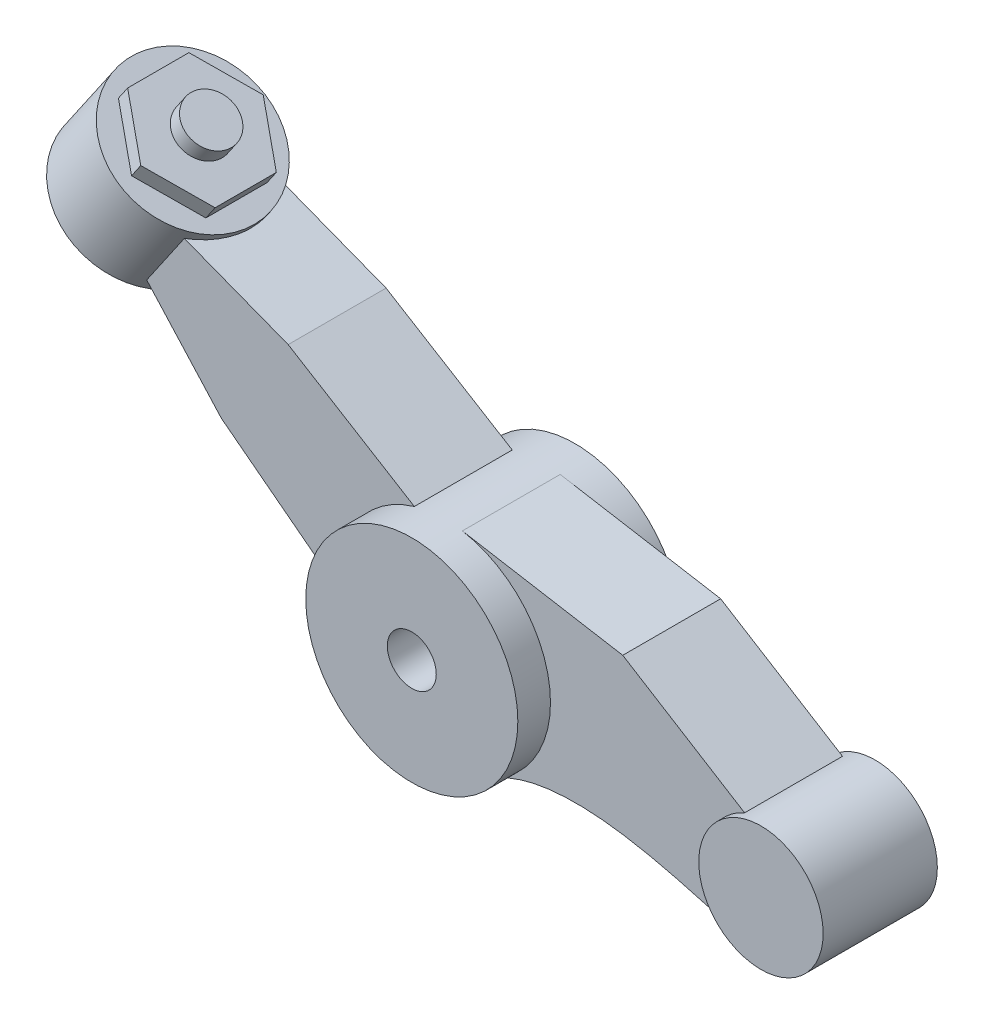
ISO-10303-21;
HEADER;
FILE_DESCRIPTION(('STEP AP214'),'2;1');
FILE_NAME('part.step','',(''),(''),'','','');
FILE_SCHEMA(('AUTOMOTIVE_DESIGN { 1 0 10303 214 1 1 1 1 }'));
ENDSEC;
DATA;
#1=APPLICATION_CONTEXT('core data for automotive mechanical design processes');
#2=APPLICATION_PROTOCOL_DEFINITION('international standard','automotive_design',2000,#1);
#3=PRODUCT_CONTEXT('',#1,'mechanical');
#4=PRODUCT('Part','Part','',(#3));
#5=PRODUCT_RELATED_PRODUCT_CATEGORY('part','',(#4));
#6=PRODUCT_DEFINITION_FORMATION('','',#4);
#7=PRODUCT_DEFINITION_CONTEXT('part definition',#1,'design');
#8=PRODUCT_DEFINITION('design','',#6,#7);
#9=PRODUCT_DEFINITION_SHAPE('','',#8);
#10=(LENGTH_UNIT() NAMED_UNIT(*) SI_UNIT(.MILLI.,.METRE.));
#11=(NAMED_UNIT(*) PLANE_ANGLE_UNIT() SI_UNIT($,.RADIAN.));
#12=(NAMED_UNIT(*) SI_UNIT($,.STERADIAN.) SOLID_ANGLE_UNIT());
#13=UNCERTAINTY_MEASURE_WITH_UNIT(LENGTH_MEASURE(1.E-05),#10,'distance_accuracy_value','');
#14=(GEOMETRIC_REPRESENTATION_CONTEXT(3) GLOBAL_UNCERTAINTY_ASSIGNED_CONTEXT((#13)) GLOBAL_UNIT_ASSIGNED_CONTEXT((#10,
#11,#12)) REPRESENTATION_CONTEXT('',''));
#15=CARTESIAN_POINT('',(0.,0.,0.));
#16=DIRECTION('',(0.,0.,1.));
#17=DIRECTION('',(1.,0.,0.));
#18=AXIS2_PLACEMENT_3D('',#15,#16,#17);
#19=CARTESIAN_POINT('',(-3.68497907935186,3.17508886054395,0.));
#20=DIRECTION('',(-0.565974647839502,-0.824422645251179,0.));
#21=DIRECTION('',(0.824422645251179,-0.565974647839502,0.));
#22=AXIS2_PLACEMENT_3D('',#19,#20,#21);
#23=PLANE('',#22);
#24=CARTESIAN_POINT('',(-3.68497907935186,3.17508886054395,0.));
#25=DIRECTION('',(-0.565974647839502,-0.824422645251179,0.));
#26=DIRECTION('',(0.824422645251179,-0.565974647839502,0.));
#27=AXIS2_PLACEMENT_3D('',#24,#25,#26);
#28=CIRCLE('',#27,0.913);
#29=CARTESIAN_POINT('',(-2.93228120423753,2.65835400706648,0.));
#30=VERTEX_POINT('',#29);
#31=EDGE_CURVE('E200',#30,#30,#28,.T.);
#32=ORIENTED_EDGE('',*,*,#31,.F.);
#33=EDGE_LOOP('',(#32));
#34=FACE_BOUND('',#33,.T.);
#35=DIRECTION('',(0.,0.,-1.));
#36=VECTOR('',#35,1.);
#37=CARTESIAN_POINT('',(-3.14910435993859,2.80720533944827,0.));
#38=LINE('',#37,#36);
#39=CARTESIAN_POINT('',(-3.14910435993859,2.80720533944827,0.375277674973257));
#40=VERTEX_POINT('',#39);
#41=CARTESIAN_POINT('',(-3.14910435993859,2.80720533944827,-0.375277674973258));
#42=VERTEX_POINT('',#41);
#43=EDGE_CURVE('E11',#40,#42,#38,.T.);
#44=ORIENTED_EDGE('',*,*,#43,.F.);
#45=DIRECTION('',(0.713970954242687,-0.49014842292696,-0.5));
#46=VECTOR('',#45,1.);
#47=CARTESIAN_POINT('',(-3.41704171964522,2.99114709999611,0.562916512459885));
#48=LINE('',#47,#46);
#49=CARTESIAN_POINT('',(-3.68497907935185,3.17508886054395,0.750555349946513));
#50=VERTEX_POINT('',#49);
#51=EDGE_CURVE('E434',#50,#40,#48,.T.);
#52=ORIENTED_EDGE('',*,*,#51,.F.);
#53=DIRECTION('',(0.713970954242688,-0.490148422926961,0.5));
#54=VECTOR('',#53,1.);
#55=CARTESIAN_POINT('',(-3.95291643905849,3.35903062109179,0.562916512459885));
#56=LINE('',#55,#54);
#57=CARTESIAN_POINT('',(-4.22085379876512,3.54297238163963,0.375277674973257));
#58=VERTEX_POINT('',#57);
#59=EDGE_CURVE('E438',#58,#50,#56,.T.);
#60=ORIENTED_EDGE('',*,*,#59,.F.);
#61=DIRECTION('',(0.,0.,1.));
#62=VECTOR('',#61,1.);
#63=CARTESIAN_POINT('',(-4.22085379876512,3.54297238163963,0.));
#64=LINE('',#63,#62);
#65=CARTESIAN_POINT('',(-4.22085379876512,3.54297238163963,-0.375277674973258));
#66=VERTEX_POINT('',#65);
#67=EDGE_CURVE('E442',#66,#58,#64,.T.);
#68=ORIENTED_EDGE('',*,*,#67,.F.);
#69=DIRECTION('',(-0.713970954242688,0.490148422926961,0.5));
#70=VECTOR('',#69,1.);
#71=CARTESIAN_POINT('',(-3.95291643905849,3.35903062109179,-0.562916512459886));
#72=LINE('',#71,#70);
#73=CARTESIAN_POINT('',(-3.68497907935186,3.17508886054395,-0.750555349946515));
#74=VERTEX_POINT('',#73);
#75=EDGE_CURVE('E65',#74,#66,#72,.T.);
#76=ORIENTED_EDGE('',*,*,#75,.F.);
#77=DIRECTION('',(-0.713970954242687,0.49014842292696,-0.5));
#78=VECTOR('',#77,1.);
#79=CARTESIAN_POINT('',(-3.41704171964522,2.99114709999611,-0.562916512459886));
#80=LINE('',#79,#78);
#81=EDGE_CURVE('E55',#42,#74,#80,.T.);
#82=ORIENTED_EDGE('',*,*,#81,.F.);
#83=EDGE_LOOP('',(#44,#52,#60,#68,#76,#82));
#84=FACE_BOUND('',#83,.T.);
#85=ADVANCED_FACE('F45',(#34,#84),#23,.F.);
#86=CARTESIAN_POINT('',(0.,0.,0.6));
#87=DIRECTION('',(0.,0.,1.));
#88=DIRECTION('',(1.,0.,0.));
#89=AXIS2_PLACEMENT_3D('',#86,#87,#88);
#90=PLANE('',#89);
#91=DIRECTION('',(0.933092962339422,-0.359635264723361,0.));
#92=VECTOR('',#91,1.);
#93=CARTESIAN_POINT('',(0.487915488116081,1.2659228747429,0.6));
#94=LINE('',#93,#92);
#95=CARTESIAN_POINT('',(-3.18822487820931,2.68279104025666,0.6));
#96=VERTEX_POINT('',#95);
#97=CARTESIAN_POINT('',(-1.91541178651957,2.1922199057091,0.6));
#98=VERTEX_POINT('',#97);
#99=EDGE_CURVE('E223',#96,#98,#94,.T.);
#100=ORIENTED_EDGE('',*,*,#99,.F.);
#101=DIRECTION('',(-0.565974647839502,-0.824422645251179,0.));
#102=VECTOR('',#101,1.);
#103=CARTESIAN_POINT('',(-3.72663022902847,1.89852700080874,0.6));
#104=LINE('',#103,#102);
#105=CARTESIAN_POINT('',(-3.64926695857222,2.01121761746144,0.6));
#106=VERTEX_POINT('',#105);
#107=EDGE_CURVE('E211',#96,#106,#104,.T.);
#108=ORIENTED_EDGE('',*,*,#107,.T.);
#109=DIRECTION('',(0.670915955160537,-0.741533398513529,0.));
#110=VECTOR('',#109,1.);
#111=CARTESIAN_POINT('',(-1.0060349069728,-0.910228550581171,0.6));
#112=LINE('',#111,#110);
#113=CARTESIAN_POINT('',(-2.73408417870121,0.999707022432565,0.6));
#114=VERTEX_POINT('',#113);
#115=EDGE_CURVE('E226',#106,#114,#112,.T.);
#116=ORIENTED_EDGE('',*,*,#115,.T.);
#117=DIRECTION('',(0.79337488847065,-0.60873334584544,0.));
#118=VECTOR('',#117,1.);
#119=CARTESIAN_POINT('',(-0.530319824058384,-0.691176907159155,0.6));
#120=LINE('',#119,#118);
#121=CARTESIAN_POINT('',(-1.29584863415519,-0.103809042756995,0.6));
#122=VERTEX_POINT('',#121);
#123=EDGE_CURVE('E229',#114,#122,#120,.T.);
#124=ORIENTED_EDGE('',*,*,#123,.T.);
#125=CARTESIAN_POINT('',(0.,0.,0.6));
#126=DIRECTION('',(0.,0.,1.));
#127=DIRECTION('',(1.,0.,0.));
#128=AXIS2_PLACEMENT_3D('',#125,#126,#127);
#129=CIRCLE('',#128,1.3);
#130=CARTESIAN_POINT('',(-0.368782160994086,1.24659525016444,0.6));
#131=VERTEX_POINT('',#130);
#132=EDGE_CURVE('E215',#131,#122,#129,.T.);
#133=ORIENTED_EDGE('',*,*,#132,.F.);
#134=DIRECTION('',(0.853168391860319,-0.521635596111383,0.));
#135=VECTOR('',#134,1.);
#136=CARTESIAN_POINT('',(0.454441504544451,0.743268156002117,0.6));
#137=LINE('',#136,#135);
#138=EDGE_CURVE('E218',#98,#131,#137,.T.);
#139=ORIENTED_EDGE('',*,*,#138,.F.);
#140=EDGE_LOOP('',(#100,#108,#116,#124,#133,#139));
#141=FACE_BOUND('',#140,.T.);
#142=ADVANCED_FACE('F311',(#141),#90,.T.);
#143=CARTESIAN_POINT('',(0.,0.,-0.6));
#144=DIRECTION('',(0.,0.,1.));
#145=DIRECTION('',(1.,0.,0.));
#146=AXIS2_PLACEMENT_3D('',#143,#144,#145);
#147=PLANE('',#146);
#148=DIRECTION('',(-0.565974647839502,-0.824422645251179,0.));
#149=VECTOR('',#148,1.);
#150=CARTESIAN_POINT('',(-3.72663022902847,1.89852700080874,-0.6));
#151=LINE('',#150,#149);
#152=CARTESIAN_POINT('',(-3.18822487820931,2.68279104025666,-0.6));
#153=VERTEX_POINT('',#152);
#154=CARTESIAN_POINT('',(-3.64926695857222,2.01121761746144,-0.6));
#155=VERTEX_POINT('',#154);
#156=EDGE_CURVE('E420',#153,#155,#151,.T.);
#157=ORIENTED_EDGE('',*,*,#156,.F.);
#158=DIRECTION('',(0.933092962339422,-0.359635264723361,0.));
#159=VECTOR('',#158,1.);
#160=CARTESIAN_POINT('',(0.487915488116081,1.2659228747429,-0.6));
#161=LINE('',#160,#159);
#162=CARTESIAN_POINT('',(-1.91541178651957,2.1922199057091,-0.6));
#163=VERTEX_POINT('',#162);
#164=EDGE_CURVE('E241',#153,#163,#161,.T.);
#165=ORIENTED_EDGE('',*,*,#164,.T.);
#166=DIRECTION('',(0.853168391860319,-0.521635596111383,0.));
#167=VECTOR('',#166,1.);
#168=CARTESIAN_POINT('',(0.454441504544451,0.743268156002117,-0.6));
#169=LINE('',#168,#167);
#170=CARTESIAN_POINT('',(-0.368782160994086,1.24659525016444,-0.6));
#171=VERTEX_POINT('',#170);
#172=EDGE_CURVE('E237',#163,#171,#169,.T.);
#173=ORIENTED_EDGE('',*,*,#172,.T.);
#174=CARTESIAN_POINT('',(0.,0.,-0.6));
#175=DIRECTION('',(0.,0.,1.));
#176=DIRECTION('',(1.,0.,0.));
#177=AXIS2_PLACEMENT_3D('',#174,#175,#176);
#178=CIRCLE('',#177,1.3);
#179=CARTESIAN_POINT('',(-1.29584863415519,-0.103809042756995,-0.6));
#180=VERTEX_POINT('',#179);
#181=EDGE_CURVE('E214',#171,#180,#178,.T.);
#182=ORIENTED_EDGE('',*,*,#181,.T.);
#183=DIRECTION('',(0.79337488847065,-0.60873334584544,0.));
#184=VECTOR('',#183,1.);
#185=CARTESIAN_POINT('',(-0.530319824058384,-0.691176907159155,-0.6));
#186=LINE('',#185,#184);
#187=CARTESIAN_POINT('',(-2.73408417870121,0.999707022432565,-0.6));
#188=VERTEX_POINT('',#187);
#189=EDGE_CURVE('E219',#188,#180,#186,.T.);
#190=ORIENTED_EDGE('',*,*,#189,.F.);
#191=DIRECTION('',(0.670915955160537,-0.741533398513529,0.));
#192=VECTOR('',#191,1.);
#193=CARTESIAN_POINT('',(-1.0060349069728,-0.910228550581171,-0.6));
#194=LINE('',#193,#192);
#195=EDGE_CURVE('E244',#155,#188,#194,.T.);
#196=ORIENTED_EDGE('',*,*,#195,.F.);
#197=EDGE_LOOP('',(#157,#165,#173,#182,#190,#196));
#198=FACE_BOUND('',#197,.T.);
#199=ADVANCED_FACE('F307',(#198),#147,.F.);
#200=CARTESIAN_POINT('',(0.,0.,1.));
#201=DIRECTION('',(0.,0.,-1.));
#202=DIRECTION('',(-1.,0.,0.));
#203=AXIS2_PLACEMENT_3D('',#200,#201,#202);
#204=CYLINDRICAL_SURFACE('',#203,0.3);
#205=CARTESIAN_POINT('',(0.,0.,1.));
#206=DIRECTION('',(0.,0.,1.));
#207=DIRECTION('',(1.,0.,0.));
#208=AXIS2_PLACEMENT_3D('',#205,#206,#207);
#209=CIRCLE('',#208,0.3);
#210=CARTESIAN_POINT('',(0.3,0.,1.));
#211=VERTEX_POINT('',#210);
#212=EDGE_CURVE('E411',#211,#211,#209,.T.);
#213=ORIENTED_EDGE('',*,*,#212,.T.);
#214=EDGE_LOOP('',(#213));
#215=FACE_BOUND('',#214,.T.);
#216=CARTESIAN_POINT('',(0.,0.,-1.));
#217=DIRECTION('',(0.,0.,1.));
#218=DIRECTION('',(1.,0.,0.));
#219=AXIS2_PLACEMENT_3D('',#216,#217,#218);
#220=CIRCLE('',#219,0.3);
#221=CARTESIAN_POINT('',(0.3,0.,-1.));
#222=VERTEX_POINT('',#221);
#223=EDGE_CURVE('E410',#222,#222,#220,.T.);
#224=ORIENTED_EDGE('',*,*,#223,.F.);
#225=EDGE_LOOP('',(#224));
#226=FACE_BOUND('',#225,.T.);
#227=ADVANCED_FACE('F47',(#215,#226),#204,.F.);
#228=CARTESIAN_POINT('',(0.,0.,1.));
#229=DIRECTION('',(0.,0.,-1.));
#230=DIRECTION('',(-1.,0.,0.));
#231=AXIS2_PLACEMENT_3D('',#228,#229,#230);
#232=CYLINDRICAL_SURFACE('',#231,1.3);
#233=DIRECTION('',(0.,0.,-1.));
#234=VECTOR('',#233,1.);
#235=CARTESIAN_POINT('',(-0.368782160994087,1.24659525016444,0.6));
#236=LINE('',#235,#234);
#237=EDGE_CURVE('E260',#131,#171,#236,.T.);
#238=ORIENTED_EDGE('',*,*,#237,.F.);
#239=ORIENTED_EDGE('',*,*,#132,.T.);
#240=DIRECTION('',(0.,0.,-1.));
#241=VECTOR('',#240,1.);
#242=CARTESIAN_POINT('',(-1.29584863415519,-0.103809042756995,0.6));
#243=LINE('',#242,#241);
#244=EDGE_CURVE('E233',#122,#180,#243,.T.);
#245=ORIENTED_EDGE('',*,*,#244,.T.);
#246=ORIENTED_EDGE('',*,*,#181,.F.);
#247=EDGE_LOOP('',(#238,#239,#245,#246));
#248=FACE_BOUND('',#247,.T.);
#249=DIRECTION('',(0.,0.,-1.));
#250=VECTOR('',#249,1.);
#251=CARTESIAN_POINT('',(0.642618961771615,-1.13006233012678,0.6));
#252=LINE('',#251,#250);
#253=CARTESIAN_POINT('',(0.642618961771614,-1.13006233012678,0.6));
#254=VERTEX_POINT('',#253);
#255=CARTESIAN_POINT('',(0.642618961771615,-1.13006233012678,-0.6));
#256=VERTEX_POINT('',#255);
#257=EDGE_CURVE('E395',#254,#256,#252,.T.);
#258=ORIENTED_EDGE('',*,*,#257,.F.);
#259=CARTESIAN_POINT('',(0.,0.,0.6));
#260=DIRECTION('',(0.,0.,1.));
#261=DIRECTION('',(1.,0.,0.));
#262=AXIS2_PLACEMENT_3D('',#259,#260,#261);
#263=CIRCLE('',#262,1.3);
#264=CARTESIAN_POINT('',(0.219469492672228,1.2813403692174,0.6));
#265=VERTEX_POINT('',#264);
#266=EDGE_CURVE('E398',#254,#265,#263,.T.);
#267=ORIENTED_EDGE('',*,*,#266,.T.);
#268=DIRECTION('',(0.,0.,-1.));
#269=VECTOR('',#268,1.);
#270=CARTESIAN_POINT('',(0.219469492672229,1.2813403692174,0.6));
#271=LINE('',#270,#269);
#272=CARTESIAN_POINT('',(0.219469492672229,1.2813403692174,-0.6));
#273=VERTEX_POINT('',#272);
#274=EDGE_CURVE('E379',#265,#273,#271,.T.);
#275=ORIENTED_EDGE('',*,*,#274,.T.);
#276=CARTESIAN_POINT('',(0.,0.,-0.6));
#277=DIRECTION('',(0.,0.,1.));
#278=DIRECTION('',(1.,0.,0.));
#279=AXIS2_PLACEMENT_3D('',#276,#277,#278);
#280=CIRCLE('',#279,1.3);
#281=EDGE_CURVE('E281',#256,#273,#280,.T.);
#282=ORIENTED_EDGE('',*,*,#281,.F.);
#283=EDGE_LOOP('',(#258,#267,#275,#282));
#284=FACE_BOUND('',#283,.T.);
#285=CARTESIAN_POINT('',(0.,0.,1.));
#286=DIRECTION('',(0.,0.,1.));
#287=DIRECTION('',(1.,0.,0.));
#288=AXIS2_PLACEMENT_3D('',#285,#286,#287);
#289=CIRCLE('',#288,1.3);
#290=CARTESIAN_POINT('',(1.3,0.,1.));
#291=VERTEX_POINT('',#290);
#292=EDGE_CURVE('E415',#291,#291,#289,.T.);
#293=ORIENTED_EDGE('',*,*,#292,.F.);
#294=EDGE_LOOP('',(#293));
#295=FACE_BOUND('',#294,.T.);
#296=CARTESIAN_POINT('',(0.,0.,-1.));
#297=DIRECTION('',(0.,0.,1.));
#298=DIRECTION('',(1.,0.,0.));
#299=AXIS2_PLACEMENT_3D('',#296,#297,#298);
#300=CIRCLE('',#299,1.3);
#301=CARTESIAN_POINT('',(1.3,0.,-1.));
#302=VERTEX_POINT('',#301);
#303=EDGE_CURVE('E416',#302,#302,#300,.T.);
#304=ORIENTED_EDGE('',*,*,#303,.T.);
#305=EDGE_LOOP('',(#304));
#306=FACE_BOUND('',#305,.T.);
#307=ADVANCED_FACE('F298',(#248,#284,#295,#306),#232,.T.);
#308=CARTESIAN_POINT('',(0.,0.,1.));
#309=DIRECTION('',(0.,0.,1.));
#310=DIRECTION('',(1.,0.,0.));
#311=AXIS2_PLACEMENT_3D('',#308,#309,#310);
#312=PLANE('',#311);
#313=ORIENTED_EDGE('',*,*,#212,.F.);
#314=EDGE_LOOP('',(#313));
#315=FACE_BOUND('',#314,.T.);
#316=ORIENTED_EDGE('',*,*,#292,.T.);
#317=EDGE_LOOP('',(#316));
#318=FACE_BOUND('',#317,.T.);
#319=ADVANCED_FACE('F295',(#315,#318),#312,.T.);
#320=CARTESIAN_POINT('',(0.,0.,-1.));
#321=DIRECTION('',(0.,0.,1.));
#322=DIRECTION('',(1.,0.,0.));
#323=AXIS2_PLACEMENT_3D('',#320,#321,#322);
#324=PLANE('',#323);
#325=ORIENTED_EDGE('',*,*,#223,.T.);
#326=EDGE_LOOP('',(#325));
#327=FACE_BOUND('',#326,.T.);
#328=ORIENTED_EDGE('',*,*,#303,.F.);
#329=EDGE_LOOP('',(#328));
#330=FACE_BOUND('',#329,.T.);
#331=ADVANCED_FACE('F292',(#327,#330),#324,.F.);
#332=CARTESIAN_POINT('',(3.49471790729051,-1.27013904860628,0.6));
#333=CARTESIAN_POINT('',(2.81920282476881,-1.08620393707761,0.6));
#334=CARTESIAN_POINT('',(1.83044377090858,-0.782374182601276,0.6));
#335=CARTESIAN_POINT('',(0.874191175743199,-0.998376942736798,0.6));
#336=CARTESIAN_POINT('',(0.642618961771614,-1.13006233012678,0.6));
#337=B_SPLINE_CURVE_WITH_KNOTS('',3,(#332,#333,#334,#335,#336),.UNSPECIFIED.,.F.,.F.,(4,1,4),
(0.,0.738093499023074,1.),.UNSPECIFIED.);
#338=DIRECTION('',(0.,0.,-1.));
#339=VECTOR('',#338,1.);
#340=SURFACE_OF_LINEAR_EXTRUSION('',#337,#339);
#341=CARTESIAN_POINT('',(3.49471790729051,-1.27013904860628,-0.6));
#342=CARTESIAN_POINT('',(2.81920282476881,-1.08620393707761,-0.6));
#343=CARTESIAN_POINT('',(1.83044377090858,-0.782374182601276,-0.6));
#344=CARTESIAN_POINT('',(0.874191175743199,-0.998376942736798,-0.6));
#345=CARTESIAN_POINT('',(0.642618961771614,-1.13006233012678,-0.6));
#346=B_SPLINE_CURVE_WITH_KNOTS('',3,(#341,#342,#343,#344,#345),.UNSPECIFIED.,.F.,.F.,(4,1,4),
(0.,0.738093499023074,1.),.UNSPECIFIED.);
#347=CARTESIAN_POINT('',(3.49471790729051,-1.27013904860628,-0.6));
#348=VERTEX_POINT('',#347);
#349=EDGE_CURVE('E269',#348,#256,#346,.T.);
#350=ORIENTED_EDGE('',*,*,#349,.F.);
#351=DIRECTION('',(0.,0.,-1.));
#352=VECTOR('',#351,1.);
#353=CARTESIAN_POINT('',(3.49471790729051,-1.27013904860628,0.6));
#354=LINE('',#353,#352);
#355=CARTESIAN_POINT('',(3.49471790729051,-1.27013904860628,0.6));
#356=VERTEX_POINT('',#355);
#357=EDGE_CURVE('E407',#356,#348,#354,.T.);
#358=ORIENTED_EDGE('',*,*,#357,.F.);
#359=EDGE_CURVE('E273',#356,#254,#337,.T.);
#360=ORIENTED_EDGE('',*,*,#359,.T.);
#361=ORIENTED_EDGE('',*,*,#257,.T.);
#362=EDGE_LOOP('',(#350,#358,#360,#361));
#363=FACE_BOUND('',#362,.T.);
#364=ADVANCED_FACE('F287',(#363),#340,.T.);
#365=CARTESIAN_POINT('',(1.02930095895387,1.66122666219238,0.6));
#366=DIRECTION('',(0.526695856062194,0.850053807242173,0.));
#367=DIRECTION('',(-0.850053807242173,0.526695856062194,0.));
#368=AXIS2_PLACEMENT_3D('',#365,#366,#367);
#369=PLANE('',#368);
#370=DIRECTION('',(0.850053807242173,-0.526695856062194,0.));
#371=VECTOR('',#370,1.);
#372=CARTESIAN_POINT('',(1.02930095895387,1.66122666219238,-0.6));
#373=LINE('',#372,#371);
#374=CARTESIAN_POINT('',(2.18604865098528,0.944502366963287,-0.6));
#375=VERTEX_POINT('',#374);
#376=CARTESIAN_POINT('',(3.67984913709172,0.0189391624780384,-0.6));
#377=VERTEX_POINT('',#376);
#378=EDGE_CURVE('E385',#375,#377,#373,.T.);
#379=ORIENTED_EDGE('',*,*,#378,.F.);
#380=DIRECTION('',(0.,0.,-1.));
#381=VECTOR('',#380,1.);
#382=CARTESIAN_POINT('',(2.18604865098528,0.944502366963287,0.6));
#383=LINE('',#382,#381);
#384=CARTESIAN_POINT('',(2.18604865098528,0.944502366963287,0.6));
#385=VERTEX_POINT('',#384);
#386=EDGE_CURVE('E381',#385,#375,#383,.T.);
#387=ORIENTED_EDGE('',*,*,#386,.F.);
#388=DIRECTION('',(0.850053807242173,-0.526695856062194,0.));
#389=VECTOR('',#388,1.);
#390=CARTESIAN_POINT('',(1.02930095895387,1.66122666219238,0.6));
#391=LINE('',#390,#389);
#392=CARTESIAN_POINT('',(3.67984913709172,0.0189391624780383,0.6));
#393=VERTEX_POINT('',#392);
#394=EDGE_CURVE('E802',#385,#393,#391,.T.);
#395=ORIENTED_EDGE('',*,*,#394,.T.);
#396=DIRECTION('',(0.,0.,-1.));
#397=VECTOR('',#396,1.);
#398=CARTESIAN_POINT('',(3.67984913709172,0.0189391624780386,0.6));
#399=LINE('',#398,#397);
#400=EDGE_CURVE('E403',#393,#377,#399,.T.);
#401=ORIENTED_EDGE('',*,*,#400,.T.);
#402=EDGE_LOOP('',(#379,#387,#395,#401));
#403=FACE_BOUND('',#402,.T.);
#404=ADVANCED_FACE('F291',(#403),#369,.T.);
#405=CARTESIAN_POINT('',(0.219469492672228,1.2813403692174,0.6));
#406=DIRECTION('',(0.168822686670945,0.985646437859542,0.));
#407=DIRECTION('',(-0.985646437859542,0.168822686670945,0.));
#408=AXIS2_PLACEMENT_3D('',#405,#406,#407);
#409=PLANE('',#408);
#410=DIRECTION('',(0.985646437859542,-0.168822686670945,0.));
#411=VECTOR('',#410,1.);
#412=CARTESIAN_POINT('',(0.219469492672228,1.2813403692174,-0.6));
#413=LINE('',#412,#411);
#414=EDGE_CURVE('E376',#273,#375,#413,.T.);
#415=ORIENTED_EDGE('',*,*,#414,.F.);
#416=ORIENTED_EDGE('',*,*,#274,.F.);
#417=DIRECTION('',(0.985646437859542,-0.168822686670945,0.));
#418=VECTOR('',#417,1.);
#419=CARTESIAN_POINT('',(0.219469492672228,1.2813403692174,0.6));
#420=LINE('',#419,#418);
#421=EDGE_CURVE('E799',#265,#385,#420,.T.);
#422=ORIENTED_EDGE('',*,*,#421,.T.);
#423=ORIENTED_EDGE('',*,*,#386,.T.);
#424=EDGE_LOOP('',(#415,#416,#422,#423));
#425=FACE_BOUND('',#424,.T.);
#426=ADVANCED_FACE('F363',(#425),#409,.T.);
#427=CARTESIAN_POINT('',(0.,0.,0.6));
#428=DIRECTION('',(0.,0.,1.));
#429=DIRECTION('',(1.,0.,0.));
#430=AXIS2_PLACEMENT_3D('',#427,#428,#429);
#431=PLANE('',#430);
#432=ORIENTED_EDGE('',*,*,#359,.F.);
#433=CARTESIAN_POINT('',(3.98,-0.682,0.6));
#434=DIRECTION('',(0.,0.,1.));
#435=DIRECTION('',(1.,0.,0.));
#436=AXIS2_PLACEMENT_3D('',#433,#434,#435);
#437=CIRCLE('',#436,0.7625);
#438=EDGE_CURVE('E280',#393,#356,#437,.T.);
#439=ORIENTED_EDGE('',*,*,#438,.F.);
#440=ORIENTED_EDGE('',*,*,#394,.F.);
#441=ORIENTED_EDGE('',*,*,#421,.F.);
#442=ORIENTED_EDGE('',*,*,#266,.F.);
#443=EDGE_LOOP('',(#432,#439,#440,#441,#442));
#444=FACE_BOUND('',#443,.T.);
#445=ADVANCED_FACE('F360',(#444),#431,.T.);
#446=CARTESIAN_POINT('',(0.,0.,-0.6));
#447=DIRECTION('',(0.,0.,1.));
#448=DIRECTION('',(1.,0.,0.));
#449=AXIS2_PLACEMENT_3D('',#446,#447,#448);
#450=PLANE('',#449);
#451=ORIENTED_EDGE('',*,*,#349,.T.);
#452=ORIENTED_EDGE('',*,*,#281,.T.);
#453=ORIENTED_EDGE('',*,*,#414,.T.);
#454=ORIENTED_EDGE('',*,*,#378,.T.);
#455=CARTESIAN_POINT('',(3.98,-0.682,-0.6));
#456=DIRECTION('',(0.,0.,1.));
#457=DIRECTION('',(1.,0.,0.));
#458=AXIS2_PLACEMENT_3D('',#455,#456,#457);
#459=CIRCLE('',#458,0.7625);
#460=EDGE_CURVE('E819',#377,#348,#459,.T.);
#461=ORIENTED_EDGE('',*,*,#460,.T.);
#462=EDGE_LOOP('',(#451,#452,#453,#454,#461));
#463=FACE_BOUND('',#462,.T.);
#464=ADVANCED_FACE('F358',(#463),#450,.F.);
#465=CARTESIAN_POINT('',(3.98,-0.682,0.7));
#466=DIRECTION('',(0.,0.,-1.));
#467=DIRECTION('',(-1.,0.,0.));
#468=AXIS2_PLACEMENT_3D('',#465,#466,#467);
#469=CYLINDRICAL_SURFACE('',#468,0.7625);
#470=ORIENTED_EDGE('',*,*,#438,.T.);
#471=ORIENTED_EDGE('',*,*,#357,.T.);
#472=ORIENTED_EDGE('',*,*,#460,.F.);
#473=ORIENTED_EDGE('',*,*,#400,.F.);
#474=EDGE_LOOP('',(#470,#471,#472,#473));
#475=FACE_BOUND('',#474,.T.);
#476=CARTESIAN_POINT('',(3.98,-0.682,0.7));
#477=DIRECTION('',(0.,0.,1.));
#478=DIRECTION('',(1.,0.,0.));
#479=AXIS2_PLACEMENT_3D('',#476,#477,#478);
#480=CIRCLE('',#479,0.7625);
#481=CARTESIAN_POINT('',(4.7425,-0.682,0.7));
#482=VERTEX_POINT('',#481);
#483=EDGE_CURVE('E265',#482,#482,#480,.T.);
#484=ORIENTED_EDGE('',*,*,#483,.F.);
#485=EDGE_LOOP('',(#484));
#486=FACE_BOUND('',#485,.T.);
#487=CARTESIAN_POINT('',(3.98,-0.682,-0.7));
#488=DIRECTION('',(0.,0.,1.));
#489=DIRECTION('',(1.,0.,0.));
#490=AXIS2_PLACEMENT_3D('',#487,#488,#489);
#491=CIRCLE('',#490,0.7625);
#492=CARTESIAN_POINT('',(4.7425,-0.682,-0.7));
#493=VERTEX_POINT('',#492);
#494=EDGE_CURVE('E264',#493,#493,#491,.T.);
#495=ORIENTED_EDGE('',*,*,#494,.T.);
#496=EDGE_LOOP('',(#495));
#497=FACE_BOUND('',#496,.T.);
#498=ADVANCED_FACE('F351',(#475,#486,#497),#469,.T.);
#499=CARTESIAN_POINT('',(0.,0.,0.7));
#500=DIRECTION('',(0.,0.,1.));
#501=DIRECTION('',(1.,0.,0.));
#502=AXIS2_PLACEMENT_3D('',#499,#500,#501);
#503=PLANE('',#502);
#504=ORIENTED_EDGE('',*,*,#483,.T.);
#505=EDGE_LOOP('',(#504));
#506=FACE_BOUND('',#505,.T.);
#507=ADVANCED_FACE('F348',(#506),#503,.T.);
#508=CARTESIAN_POINT('',(0.,0.,-0.7));
#509=DIRECTION('',(0.,0.,1.));
#510=DIRECTION('',(1.,0.,0.));
#511=AXIS2_PLACEMENT_3D('',#508,#509,#510);
#512=PLANE('',#511);
#513=ORIENTED_EDGE('',*,*,#494,.F.);
#514=EDGE_LOOP('',(#513));
#515=FACE_BOUND('',#514,.T.);
#516=ADVANCED_FACE('F346',(#515),#512,.F.);
#517=CARTESIAN_POINT('',(0.454441504544451,0.743268156002117,0.6));
#518=DIRECTION('',(0.521635596111383,0.853168391860319,0.));
#519=DIRECTION('',(-0.853168391860319,0.521635596111383,0.));
#520=AXIS2_PLACEMENT_3D('',#517,#518,#519);
#521=PLANE('',#520);
#522=ORIENTED_EDGE('',*,*,#172,.F.);
#523=DIRECTION('',(0.,0.,-1.));
#524=VECTOR('',#523,1.);
#525=CARTESIAN_POINT('',(-1.91541178651957,2.1922199057091,0.6));
#526=LINE('',#525,#524);
#527=EDGE_CURVE('E256',#98,#163,#526,.T.);
#528=ORIENTED_EDGE('',*,*,#527,.F.);
#529=ORIENTED_EDGE('',*,*,#138,.T.);
#530=ORIENTED_EDGE('',*,*,#237,.T.);
#531=EDGE_LOOP('',(#522,#528,#529,#530));
#532=FACE_BOUND('',#531,.T.);
#533=ADVANCED_FACE('F342',(#532),#521,.T.);
#534=CARTESIAN_POINT('',(0.487915488116081,1.2659228747429,0.6));
#535=DIRECTION('',(0.359635264723361,0.933092962339422,0.));
#536=DIRECTION('',(-0.933092962339422,0.359635264723361,0.));
#537=AXIS2_PLACEMENT_3D('',#534,#535,#536);
#538=PLANE('',#537);
#539=ORIENTED_EDGE('',*,*,#164,.F.);
#540=CARTESIAN_POINT('',(-3.84829439449099,2.93719685490199,0.));
#541=DIRECTION('',(0.359635264723361,0.933092962339422,0.));
#542=DIRECTION('',(-0.933092962339422,0.359635264723361,0.));
#543=AXIS2_PLACEMENT_3D('',#540,#541,#542);
#544=ELLIPSE('',#543,0.938520811078153,0.913);
#545=EDGE_CURVE('E208',#153,#96,#544,.F.);
#546=ORIENTED_EDGE('',*,*,#545,.T.);
#547=ORIENTED_EDGE('',*,*,#99,.T.);
#548=ORIENTED_EDGE('',*,*,#527,.T.);
#549=EDGE_LOOP('',(#539,#546,#547,#548));
#550=FACE_BOUND('',#549,.T.);
#551=ADVANCED_FACE('F338',(#550),#538,.T.);
#552=CARTESIAN_POINT('',(-1.0060349069728,-0.910228550581171,0.6));
#553=DIRECTION('',(0.741533398513529,0.670915955160537,0.));
#554=DIRECTION('',(-0.670915955160537,0.741533398513529,0.));
#555=AXIS2_PLACEMENT_3D('',#552,#553,#554);
#556=PLANE('',#555);
#557=CARTESIAN_POINT('',(-4.1238725850879,2.535777989706,0.));
#558=DIRECTION('',(0.741533398513529,0.670915955160537,0.));
#559=DIRECTION('',(0.670915955160537,-0.741533398513529,0.));
#560=AXIS2_PLACEMENT_3D('',#557,#558,#559);
#561=ELLIPSE('',#560,0.938520811078154,0.913);
#562=EDGE_CURVE('E204',#155,#106,#561,.F.);
#563=ORIENTED_EDGE('',*,*,#562,.F.);
#564=ORIENTED_EDGE('',*,*,#195,.T.);
#565=DIRECTION('',(0.,0.,-1.));
#566=VECTOR('',#565,1.);
#567=CARTESIAN_POINT('',(-2.73408417870121,0.999707022432565,0.6));
#568=LINE('',#567,#566);
#569=EDGE_CURVE('E252',#114,#188,#568,.T.);
#570=ORIENTED_EDGE('',*,*,#569,.F.);
#571=ORIENTED_EDGE('',*,*,#115,.F.);
#572=EDGE_LOOP('',(#563,#564,#570,#571));
#573=FACE_BOUND('',#572,.T.);
#574=ADVANCED_FACE('F334',(#573),#556,.F.);
#575=CARTESIAN_POINT('',(-0.530319824058384,-0.691176907159155,0.6));
#576=DIRECTION('',(0.60873334584544,0.79337488847065,0.));
#577=DIRECTION('',(-0.79337488847065,0.60873334584544,0.));
#578=AXIS2_PLACEMENT_3D('',#575,#576,#577);
#579=PLANE('',#578);
#580=ORIENTED_EDGE('',*,*,#189,.T.);
#581=ORIENTED_EDGE('',*,*,#244,.F.);
#582=ORIENTED_EDGE('',*,*,#123,.F.);
#583=ORIENTED_EDGE('',*,*,#569,.T.);
#584=EDGE_LOOP('',(#580,#581,#582,#583));
#585=FACE_BOUND('',#584,.T.);
#586=ADVANCED_FACE('F326',(#585),#579,.F.);
#587=CARTESIAN_POINT('',(-5.04666567554149,2.80474494773115,0.));
#588=DIRECTION('',(0.565974647839502,0.824422645251179,0.));
#589=DIRECTION('',(-0.824422645251179,0.565974647839502,0.));
#590=AXIS2_PLACEMENT_3D('',#587,#588,#589);
#591=PLANE('',#590);
#592=CARTESIAN_POINT('',(-4.29396780042716,2.28801009425368,0.));
#593=DIRECTION('',(0.565974647839502,0.824422645251179,0.));
#594=DIRECTION('',(-0.824422645251179,0.565974647839502,0.));
#595=AXIS2_PLACEMENT_3D('',#592,#593,#594);
#596=CIRCLE('',#595,0.32331351926487);
#597=CARTESIAN_POINT('',(-4.56051478722497,2.47099734946137,0.));
#598=VERTEX_POINT('',#597);
#599=EDGE_CURVE('E430',#598,#598,#596,.F.);
#600=ORIENTED_EDGE('',*,*,#599,.F.);
#601=EDGE_LOOP('',(#600));
#602=FACE_BOUND('',#601,.T.);
#603=CARTESIAN_POINT('',(-4.29396780042716,2.28801009425368,0.));
#604=DIRECTION('',(-0.565974647839502,-0.824422645251179,0.));
#605=DIRECTION('',(0.824422645251179,-0.565974647839502,0.));
#606=AXIS2_PLACEMENT_3D('',#603,#604,#605);
#607=CIRCLE('',#606,0.913);
#608=CARTESIAN_POINT('',(-3.54126992531283,1.77127524077621,0.));
#609=VERTEX_POINT('',#608);
#610=EDGE_CURVE('E191',#609,#609,#607,.T.);
#611=ORIENTED_EDGE('',*,*,#610,.T.);
#612=EDGE_LOOP('',(#611));
#613=FACE_BOUND('',#612,.T.);
#614=ADVANCED_FACE('F324',(#602,#613),#591,.F.);
#615=CARTESIAN_POINT('',(-4.29396780042716,2.28801009425368,0.));
#616=DIRECTION('',(-0.565974647839502,-0.824422645251179,0.));
#617=DIRECTION('',(0.824422645251179,-0.565974647839502,0.));
#618=AXIS2_PLACEMENT_3D('',#615,#616,#617);
#619=CYLINDRICAL_SURFACE('',#618,0.913);
#620=ORIENTED_EDGE('',*,*,#107,.F.);
#621=ORIENTED_EDGE('',*,*,#545,.F.);
#622=ORIENTED_EDGE('',*,*,#156,.T.);
#623=ORIENTED_EDGE('',*,*,#562,.T.);
#624=EDGE_LOOP('',(#620,#621,#622,#623));
#625=FACE_BOUND('',#624,.T.);
#626=ORIENTED_EDGE('',*,*,#610,.F.);
#627=EDGE_LOOP('',(#626));
#628=FACE_BOUND('',#627,.T.);
#629=ORIENTED_EDGE('',*,*,#31,.T.);
#630=EDGE_LOOP('',(#629));
#631=FACE_BOUND('',#630,.T.);
#632=ADVANCED_FACE('F322',(#625,#628,#631),#619,.T.);
#633=CARTESIAN_POINT('',(-4.47701957952069,2.02136911923068,0.));
#634=DIRECTION('',(0.565974647839503,0.824422645251179,0.));
#635=DIRECTION('',(-0.824422645251179,0.565974647839503,0.));
#636=AXIS2_PLACEMENT_3D('',#633,#634,#635);
#637=CONICAL_SURFACE('',#636,0.211029979115793,0.334149250679293);
#638=CARTESIAN_POINT('',(-4.47701957952069,2.02136911923068,0.));
#639=DIRECTION('',(0.565974647839503,0.824422645251179,0.));
#640=DIRECTION('',(-0.824422645251179,0.565974647839503,0.));
#641=AXIS2_PLACEMENT_3D('',#638,#639,#640);
#642=CIRCLE('',#641,0.211029979115793);
#643=CARTESIAN_POINT('',(-4.65099747313064,2.14080673734432,0.));
#644=VERTEX_POINT('',#643);
#645=EDGE_CURVE('E186',#644,#644,#642,.T.);
#646=ORIENTED_EDGE('',*,*,#645,.T.);
#647=EDGE_LOOP('',(#646));
#648=FACE_BOUND('',#647,.T.);
#649=ORIENTED_EDGE('',*,*,#599,.T.);
#650=EDGE_LOOP('',(#649));
#651=FACE_BOUND('',#650,.T.);
#652=ADVANCED_FACE('F507',(#648,#651),#637,.T.);
#653=CARTESIAN_POINT('',(-4.6350535944478,1.79117007917966,0.));
#654=DIRECTION('',(0.565974647839503,0.824422645251179,0.));
#655=DIRECTION('',(0.824422645251179,-0.565974647839503,0.));
#656=AXIS2_PLACEMENT_3D('',#653,#654,#655);
#657=SPHERICAL_SURFACE('',#656,0.35);
#658=ORIENTED_EDGE('',*,*,#645,.F.);
#659=EDGE_LOOP('',(#658));
#660=FACE_BOUND('',#659,.T.);
#661=ADVANCED_FACE('F505',(#660),#657,.T.);
#662=CARTESIAN_POINT('',(-3.03590943037069,2.97208986849851,0.375277674973257));
#663=DIRECTION('',(-0.824422645251179,0.565974647839502,0.));
#664=DIRECTION('',(-0.565974647839502,-0.824422645251179,0.));
#665=AXIS2_PLACEMENT_3D('',#662,#663,#664);
#666=PLANE('',#665);
#667=DIRECTION('',(-0.565974647839502,-0.824422645251179,0.));
#668=VECTOR('',#667,1.);
#669=CARTESIAN_POINT('',(-3.03590943037069,2.97208986849851,0.375277674973257));
#670=LINE('',#669,#668);
#671=CARTESIAN_POINT('',(-3.03590943037069,2.97208986849851,0.375277674973257));
#672=VERTEX_POINT('',#671);
#673=EDGE_CURVE('E465',#672,#40,#670,.T.);
#674=ORIENTED_EDGE('',*,*,#673,.T.);
#675=ORIENTED_EDGE('',*,*,#43,.T.);
#676=DIRECTION('',(-0.565974647839502,-0.824422645251179,0.));
#677=VECTOR('',#676,1.);
#678=CARTESIAN_POINT('',(-3.03590943037069,2.97208986849851,-0.375277674973258));
#679=LINE('',#678,#677);
#680=CARTESIAN_POINT('',(-3.03590943037069,2.97208986849851,-0.375277674973258));
#681=VERTEX_POINT('',#680);
#682=EDGE_CURVE('E166',#681,#42,#679,.T.);
#683=ORIENTED_EDGE('',*,*,#682,.F.);
#684=DIRECTION('',(0.,0.,-1.));
#685=VECTOR('',#684,1.);
#686=CARTESIAN_POINT('',(-3.03590943037069,2.97208986849851,0.375277674973257));
#687=LINE('',#686,#685);
#688=EDGE_CURVE('E173',#672,#681,#687,.T.);
#689=ORIENTED_EDGE('',*,*,#688,.F.);
#690=EDGE_LOOP('',(#674,#675,#683,#689));
#691=FACE_BOUND('',#690,.T.);
#692=ADVANCED_FACE('F184',(#691),#666,.F.);
#693=CARTESIAN_POINT('',(-3.03590943037069,2.97208986849851,-0.375277674973258));
#694=DIRECTION('',(-0.412211322625589,0.282987323919751,0.866025403784439));
#695=DIRECTION('',(0.902934052856613,0.,0.429779124890835));
#696=AXIS2_PLACEMENT_3D('',#693,#694,#695);
#697=PLANE('',#696);
#698=ORIENTED_EDGE('',*,*,#682,.T.);
#699=ORIENTED_EDGE('',*,*,#81,.T.);
#700=DIRECTION('',(-0.565974647839502,-0.824422645251179,0.));
#701=VECTOR('',#700,1.);
#702=CARTESIAN_POINT('',(-3.57178414978395,3.33997338959419,-0.750555349946515));
#703=LINE('',#702,#701);
#704=CARTESIAN_POINT('',(-3.57178414978395,3.33997338959419,-0.750555349946515));
#705=VERTEX_POINT('',#704);
#706=EDGE_CURVE('E168',#705,#74,#703,.T.);
#707=ORIENTED_EDGE('',*,*,#706,.F.);
#708=DIRECTION('',(-0.713970954242687,0.490148422926961,-0.5));
#709=VECTOR('',#708,1.);
#710=CARTESIAN_POINT('',(-3.03590943037069,2.97208986849851,-0.375277674973258));
#711=LINE('',#710,#709);
#712=EDGE_CURVE('E162',#681,#705,#711,.T.);
#713=ORIENTED_EDGE('',*,*,#712,.F.);
#714=EDGE_LOOP('',(#698,#699,#707,#713));
#715=FACE_BOUND('',#714,.T.);
#716=ADVANCED_FACE('F164',(#715),#697,.F.);
#717=CARTESIAN_POINT('',(-3.57178414978395,3.33997338959419,-0.750555349946515));
#718=DIRECTION('',(0.412211322625589,-0.282987323919751,0.866025403784439));
#719=DIRECTION('',(0.902934052856613,0.,-0.429779124890835));
#720=AXIS2_PLACEMENT_3D('',#717,#718,#719);
#721=PLANE('',#720);
#722=ORIENTED_EDGE('',*,*,#706,.T.);
#723=ORIENTED_EDGE('',*,*,#75,.T.);
#724=DIRECTION('',(-0.565974647839502,-0.824422645251179,0.));
#725=VECTOR('',#724,1.);
#726=CARTESIAN_POINT('',(-4.10765886919722,3.70785691068986,-0.375277674973258));
#727=LINE('',#726,#725);
#728=CARTESIAN_POINT('',(-4.10765886919722,3.70785691068986,-0.375277674973258));
#729=VERTEX_POINT('',#728);
#730=EDGE_CURVE('E193',#729,#66,#727,.T.);
#731=ORIENTED_EDGE('',*,*,#730,.F.);
#732=DIRECTION('',(-0.713970954242688,0.49014842292696,0.5));
#733=VECTOR('',#732,1.);
#734=CARTESIAN_POINT('',(-3.57178414978395,3.33997338959419,-0.750555349946515));
#735=LINE('',#734,#733);
#736=EDGE_CURVE('E172',#705,#729,#735,.T.);
#737=ORIENTED_EDGE('',*,*,#736,.F.);
#738=EDGE_LOOP('',(#722,#723,#731,#737));
#739=FACE_BOUND('',#738,.T.);
#740=ADVANCED_FACE('F450',(#739),#721,.F.);
#741=CARTESIAN_POINT('',(-4.10765886919722,3.70785691068986,-0.375277674973258));
#742=DIRECTION('',(0.824422645251179,-0.565974647839502,0.));
#743=DIRECTION('',(0.565974647839502,0.824422645251179,0.));
#744=AXIS2_PLACEMENT_3D('',#741,#742,#743);
#745=PLANE('',#744);
#746=ORIENTED_EDGE('',*,*,#730,.T.);
#747=ORIENTED_EDGE('',*,*,#67,.T.);
#748=DIRECTION('',(-0.565974647839502,-0.824422645251179,0.));
#749=VECTOR('',#748,1.);
#750=CARTESIAN_POINT('',(-4.10765886919722,3.70785691068986,0.375277674973257));
#751=LINE('',#750,#749);
#752=CARTESIAN_POINT('',(-4.10765886919722,3.70785691068986,0.375277674973257));
#753=VERTEX_POINT('',#752);
#754=EDGE_CURVE('E472',#753,#58,#751,.T.);
#755=ORIENTED_EDGE('',*,*,#754,.F.);
#756=DIRECTION('',(0.,0.,1.));
#757=VECTOR('',#756,1.);
#758=CARTESIAN_POINT('',(-4.10765886919722,3.70785691068986,-0.375277674973258));
#759=LINE('',#758,#757);
#760=EDGE_CURVE('E455',#729,#753,#759,.T.);
#761=ORIENTED_EDGE('',*,*,#760,.F.);
#762=EDGE_LOOP('',(#746,#747,#755,#761));
#763=FACE_BOUND('',#762,.T.);
#764=ADVANCED_FACE('F477',(#763),#745,.F.);
#765=CARTESIAN_POINT('',(-4.10765886919722,3.70785691068986,0.375277674973257));
#766=DIRECTION('',(0.412211322625589,-0.282987323919751,-0.866025403784439));
#767=DIRECTION('',(-0.902934052856613,0.,-0.429779124890835));
#768=AXIS2_PLACEMENT_3D('',#765,#766,#767);
#769=PLANE('',#768);
#770=ORIENTED_EDGE('',*,*,#754,.T.);
#771=ORIENTED_EDGE('',*,*,#59,.T.);
#772=DIRECTION('',(-0.565974647839502,-0.824422645251179,0.));
#773=VECTOR('',#772,1.);
#774=CARTESIAN_POINT('',(-3.57178414978395,3.33997338959419,0.750555349946513));
#775=LINE('',#774,#773);
#776=CARTESIAN_POINT('',(-3.57178414978395,3.33997338959419,0.750555349946513));
#777=VERTEX_POINT('',#776);
#778=EDGE_CURVE('E468',#777,#50,#775,.T.);
#779=ORIENTED_EDGE('',*,*,#778,.F.);
#780=DIRECTION('',(0.713970954242688,-0.49014842292696,0.5));
#781=VECTOR('',#780,1.);
#782=CARTESIAN_POINT('',(-4.10765886919722,3.70785691068986,0.375277674973257));
#783=LINE('',#782,#781);
#784=EDGE_CURVE('E458',#753,#777,#783,.T.);
#785=ORIENTED_EDGE('',*,*,#784,.F.);
#786=EDGE_LOOP('',(#770,#771,#779,#785));
#787=FACE_BOUND('',#786,.T.);
#788=ADVANCED_FACE('F482',(#787),#769,.F.);
#789=CARTESIAN_POINT('',(-3.57178414978395,3.33997338959419,0.750555349946513));
#790=DIRECTION('',(-0.41221132262559,0.282987323919751,-0.866025403784439));
#791=DIRECTION('',(-0.902934052856612,0.,0.429779124890835));
#792=AXIS2_PLACEMENT_3D('',#789,#790,#791);
#793=PLANE('',#792);
#794=ORIENTED_EDGE('',*,*,#778,.T.);
#795=ORIENTED_EDGE('',*,*,#51,.T.);
#796=ORIENTED_EDGE('',*,*,#673,.F.);
#797=DIRECTION('',(0.713970954242687,-0.490148422926961,-0.5));
#798=VECTOR('',#797,1.);
#799=CARTESIAN_POINT('',(-3.57178414978395,3.33997338959419,0.750555349946513));
#800=LINE('',#799,#798);
#801=EDGE_CURVE('E178',#777,#672,#800,.T.);
#802=ORIENTED_EDGE('',*,*,#801,.F.);
#803=EDGE_LOOP('',(#794,#795,#796,#802));
#804=FACE_BOUND('',#803,.T.);
#805=ADVANCED_FACE('F484',(#804),#793,.F.);
#806=CARTESIAN_POINT('',(0.414299340005495,0.603485967290191,0.));
#807=DIRECTION('',(0.565974647839503,0.824422645251179,0.));
#808=DIRECTION('',(-0.824422645251179,0.565974647839503,0.));
#809=AXIS2_PLACEMENT_3D('',#806,#807,#808);
#810=PLANE('',#809);
#811=CARTESIAN_POINT('',(-3.57178414978395,3.33997338959419,0.));
#812=DIRECTION('',(0.565974647839503,0.824422645251179,0.));
#813=DIRECTION('',(-0.824422645251179,0.565974647839503,0.));
#814=AXIS2_PLACEMENT_3D('',#811,#812,#813);
#815=CIRCLE('',#814,0.299999999999999);
#816=CARTESIAN_POINT('',(-3.81911094335931,3.50976578394604,0.));
#817=VERTEX_POINT('',#816);
#818=EDGE_CURVE('E49',#817,#817,#815,.F.);
#819=ORIENTED_EDGE('',*,*,#818,.T.);
#820=EDGE_LOOP('',(#819));
#821=FACE_BOUND('',#820,.T.);
#822=ORIENTED_EDGE('',*,*,#688,.T.);
#823=ORIENTED_EDGE('',*,*,#712,.T.);
#824=ORIENTED_EDGE('',*,*,#736,.T.);
#825=ORIENTED_EDGE('',*,*,#760,.T.);
#826=ORIENTED_EDGE('',*,*,#784,.T.);
#827=ORIENTED_EDGE('',*,*,#801,.T.);
#828=EDGE_LOOP('',(#822,#823,#824,#825,#826,#827));
#829=FACE_BOUND('',#828,.T.);
#830=ADVANCED_FACE('F176',(#821,#829),#810,.T.);
#831=CARTESIAN_POINT('',(-3.45858922021605,3.50485791864442,0.));
#832=DIRECTION('',(-0.565974647839503,-0.824422645251179,0.));
#833=DIRECTION('',(0.824422645251179,-0.565974647839503,0.));
#834=AXIS2_PLACEMENT_3D('',#831,#832,#833);
#835=CYLINDRICAL_SURFACE('',#834,0.299999999999999);
#836=ORIENTED_EDGE('',*,*,#818,.F.);
#837=EDGE_LOOP('',(#836));
#838=FACE_BOUND('',#837,.T.);
#839=CARTESIAN_POINT('',(-3.45858922021605,3.50485791864442,0.));
#840=DIRECTION('',(0.565974647839503,0.824422645251179,0.));
#841=DIRECTION('',(-0.824422645251179,0.565974647839503,0.));
#842=AXIS2_PLACEMENT_3D('',#839,#840,#841);
#843=CIRCLE('',#842,0.299999999999999);
#844=CARTESIAN_POINT('',(-3.7059160137914,3.67465031299627,0.));
#845=VERTEX_POINT('',#844);
#846=EDGE_CURVE('E750',#845,#845,#843,.T.);
#847=ORIENTED_EDGE('',*,*,#846,.F.);
#848=EDGE_LOOP('',(#847));
#849=FACE_BOUND('',#848,.T.);
#850=ADVANCED_FACE('F491',(#838,#849),#835,.T.);
#851=CARTESIAN_POINT('',(-3.45858922021605,3.50485791864442,0.));
#852=DIRECTION('',(0.565974647839503,0.824422645251179,0.));
#853=DIRECTION('',(-0.824422645251179,0.565974647839503,0.));
#854=AXIS2_PLACEMENT_3D('',#851,#852,#853);
#855=PLANE('',#854);
#856=ORIENTED_EDGE('',*,*,#846,.T.);
#857=EDGE_LOOP('',(#856));
#858=FACE_BOUND('',#857,.T.);
#859=ADVANCED_FACE('F717',(#858),#855,.T.);
#860=CLOSED_SHELL('',(#85,#142,#199,#227,#307,#319,#331,#364,#404,#426,#445,#464,#498,#507,#516,
#533,#551,#574,#586,#614,#632,#652,#661,#692,#716,#740,#764,#788,#805,#830,#850,#859));
#861=MANIFOLD_SOLID_BREP('B2',#860);
#862=ADVANCED_BREP_SHAPE_REPRESENTATION('',(#18,#861),#14);
#863=SHAPE_DEFINITION_REPRESENTATION(#9,#862);
ENDSEC;
END-ISO-10303-21;
